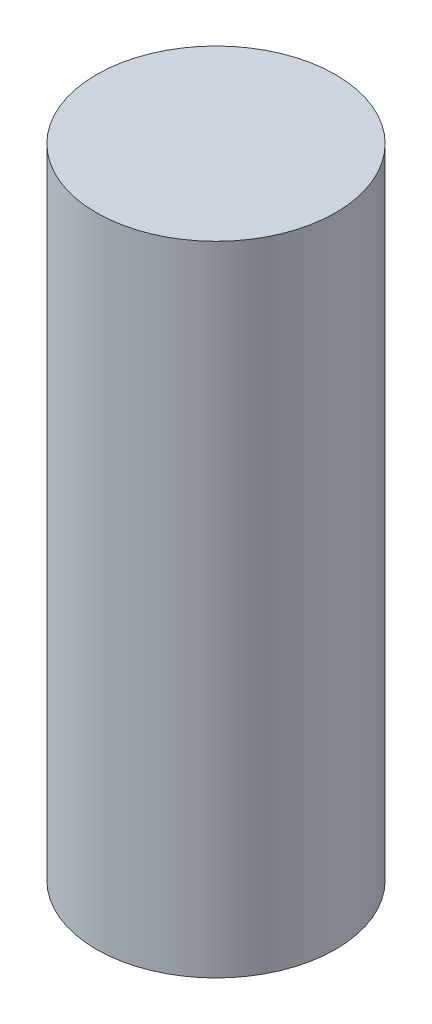
ISO-10303-21;
HEADER;
FILE_DESCRIPTION(('STEP AP214'),'2;1');
FILE_NAME('part.step','',(''),(''),'','','');
FILE_SCHEMA(('AUTOMOTIVE_DESIGN { 1 0 10303 214 1 1 1 1 }'));
ENDSEC;
DATA;
#1=APPLICATION_CONTEXT('core data for automotive mechanical design processes');
#2=APPLICATION_PROTOCOL_DEFINITION('international standard','automotive_design',2000,#1);
#3=PRODUCT_CONTEXT('',#1,'mechanical');
#4=PRODUCT('Part','Part','',(#3));
#5=PRODUCT_RELATED_PRODUCT_CATEGORY('part','',(#4));
#6=PRODUCT_DEFINITION_FORMATION('','',#4);
#7=PRODUCT_DEFINITION_CONTEXT('part definition',#1,'design');
#8=PRODUCT_DEFINITION('design','',#6,#7);
#9=PRODUCT_DEFINITION_SHAPE('','',#8);
#10=(LENGTH_UNIT() NAMED_UNIT(*) SI_UNIT(.MILLI.,.METRE.));
#11=(NAMED_UNIT(*) PLANE_ANGLE_UNIT() SI_UNIT($,.RADIAN.));
#12=(NAMED_UNIT(*) SI_UNIT($,.STERADIAN.) SOLID_ANGLE_UNIT());
#13=UNCERTAINTY_MEASURE_WITH_UNIT(LENGTH_MEASURE(1.E-05),#10,'distance_accuracy_value','');
#14=(GEOMETRIC_REPRESENTATION_CONTEXT(3) GLOBAL_UNCERTAINTY_ASSIGNED_CONTEXT((#13)) GLOBAL_UNIT_ASSIGNED_CONTEXT((#10,
#11,#12)) REPRESENTATION_CONTEXT('',''));
#15=CARTESIAN_POINT('',(0.,0.,0.));
#16=DIRECTION('',(0.,0.,1.));
#17=DIRECTION('',(1.,0.,0.));
#18=AXIS2_PLACEMENT_3D('',#15,#16,#17);
#19=CARTESIAN_POINT('',(0.,50.8,0.));
#20=DIRECTION('',(0.,-1.,0.));
#21=DIRECTION('',(0.,0.,-1.));
#22=AXIS2_PLACEMENT_3D('',#19,#20,#21);
#23=CYLINDRICAL_SURFACE('',#22,9.525);
#24=CARTESIAN_POINT('',(0.,50.8,0.));
#25=DIRECTION('',(0.,1.,0.));
#26=DIRECTION('',(0.,0.,1.));
#27=AXIS2_PLACEMENT_3D('',#24,#25,#26);
#28=CIRCLE('',#27,9.525);
#29=CARTESIAN_POINT('',(0.,50.8,9.525));
#30=VERTEX_POINT('',#29);
#31=EDGE_CURVE('E10',#30,#30,#28,.T.);
#32=ORIENTED_EDGE('',*,*,#31,.F.);
#33=EDGE_LOOP('',(#32));
#34=FACE_BOUND('',#33,.T.);
#35=CARTESIAN_POINT('',(0.,0.,0.));
#36=DIRECTION('',(0.,1.,0.));
#37=DIRECTION('',(0.,0.,1.));
#38=AXIS2_PLACEMENT_3D('',#35,#36,#37);
#39=CIRCLE('',#38,9.525);
#40=CARTESIAN_POINT('',(0.,0.,9.525));
#41=VERTEX_POINT('',#40);
#42=EDGE_CURVE('E34',#41,#41,#39,.T.);
#43=ORIENTED_EDGE('',*,*,#42,.T.);
#44=EDGE_LOOP('',(#43));
#45=FACE_BOUND('',#44,.T.);
#46=ADVANCED_FACE('F31',(#34,#45),#23,.T.);
#47=CARTESIAN_POINT('',(0.,50.8,0.));
#48=DIRECTION('',(0.,1.,0.));
#49=DIRECTION('',(0.,0.,1.));
#50=AXIS2_PLACEMENT_3D('',#47,#48,#49);
#51=PLANE('',#50);
#52=ORIENTED_EDGE('',*,*,#31,.T.);
#53=EDGE_LOOP('',(#52));
#54=FACE_BOUND('',#53,.T.);
#55=ADVANCED_FACE('F46',(#54),#51,.T.);
#56=CARTESIAN_POINT('',(0.,0.,0.));
#57=DIRECTION('',(0.,1.,0.));
#58=DIRECTION('',(0.,0.,1.));
#59=AXIS2_PLACEMENT_3D('',#56,#57,#58);
#60=PLANE('',#59);
#61=ORIENTED_EDGE('',*,*,#42,.F.);
#62=EDGE_LOOP('',(#61));
#63=FACE_BOUND('',#62,.T.);
#64=ADVANCED_FACE('F44',(#63),#60,.F.);
#65=CLOSED_SHELL('',(#46,#55,#64));
#66=MANIFOLD_SOLID_BREP('B2',#65);
#67=ADVANCED_BREP_SHAPE_REPRESENTATION('',(#18,#66),#14);
#68=SHAPE_DEFINITION_REPRESENTATION(#9,#67);
ENDSEC;
END-ISO-10303-21;
